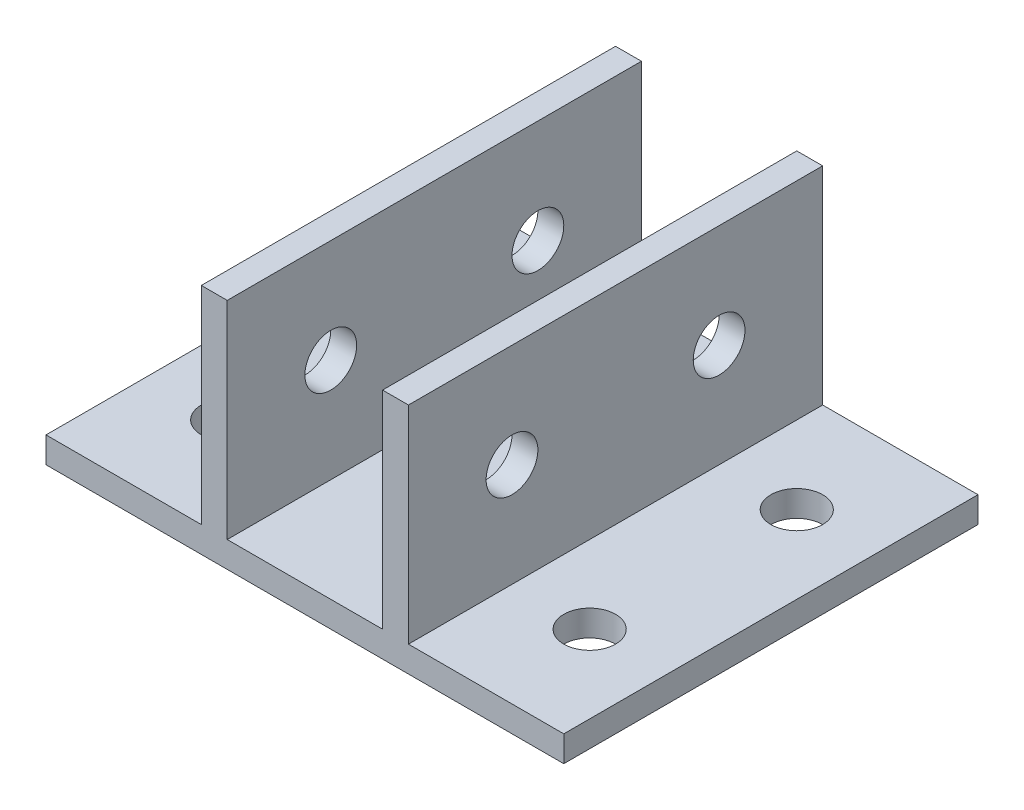
ISO-10303-21;
HEADER;
FILE_DESCRIPTION(('STEP AP214'),'2;1');
FILE_NAME('part.step','',(''),(''),'','','');
FILE_SCHEMA(('AUTOMOTIVE_DESIGN { 1 0 10303 214 1 1 1 1 }'));
ENDSEC;
DATA;
#1=APPLICATION_CONTEXT('core data for automotive mechanical design processes');
#2=APPLICATION_PROTOCOL_DEFINITION('international standard','automotive_design',2000,#1);
#3=PRODUCT_CONTEXT('',#1,'mechanical');
#4=PRODUCT('Part','Part','',(#3));
#5=PRODUCT_RELATED_PRODUCT_CATEGORY('part','',(#4));
#6=PRODUCT_DEFINITION_FORMATION('','',#4);
#7=PRODUCT_DEFINITION_CONTEXT('part definition',#1,'design');
#8=PRODUCT_DEFINITION('design','',#6,#7);
#9=PRODUCT_DEFINITION_SHAPE('','',#8);
#10=(LENGTH_UNIT() NAMED_UNIT(*) SI_UNIT(.MILLI.,.METRE.));
#11=(NAMED_UNIT(*) PLANE_ANGLE_UNIT() SI_UNIT($,.RADIAN.));
#12=(NAMED_UNIT(*) SI_UNIT($,.STERADIAN.) SOLID_ANGLE_UNIT());
#13=UNCERTAINTY_MEASURE_WITH_UNIT(LENGTH_MEASURE(1.E-05),#10,'distance_accuracy_value','');
#14=(GEOMETRIC_REPRESENTATION_CONTEXT(3) GLOBAL_UNCERTAINTY_ASSIGNED_CONTEXT((#13)) GLOBAL_UNIT_ASSIGNED_CONTEXT((#10,
#11,#12)) REPRESENTATION_CONTEXT('',''));
#15=CARTESIAN_POINT('',(0.,0.,0.));
#16=DIRECTION('',(0.,0.,1.));
#17=DIRECTION('',(1.,0.,0.));
#18=AXIS2_PLACEMENT_3D('',#15,#16,#17);
#19=CARTESIAN_POINT('',(0.,0.,50.8));
#20=DIRECTION('',(0.,1.,0.));
#21=DIRECTION('',(0.,0.,1.));
#22=AXIS2_PLACEMENT_3D('',#19,#20,#21);
#23=PLANE('',#22);
#24=CARTESIAN_POINT('',(53.975,0.,38.1));
#25=DIRECTION('',(0.,1.,0.));
#26=DIRECTION('',(-1.,0.,0.));
#27=AXIS2_PLACEMENT_3D('',#24,#25,#26);
#28=CIRCLE('',#27,3.175);
#29=CARTESIAN_POINT('',(50.8,0.,38.1));
#30=VERTEX_POINT('',#29);
#31=EDGE_CURVE('E267',#30,#30,#28,.F.);
#32=ORIENTED_EDGE('',*,*,#31,.F.);
#33=EDGE_LOOP('',(#32));
#34=FACE_BOUND('',#33,.T.);
#35=CARTESIAN_POINT('',(9.525,0.,12.7));
#36=DIRECTION('',(0.,1.,0.));
#37=DIRECTION('',(-1.,0.,0.));
#38=AXIS2_PLACEMENT_3D('',#35,#36,#37);
#39=CIRCLE('',#38,3.175);
#40=CARTESIAN_POINT('',(6.35,0.,12.7));
#41=VERTEX_POINT('',#40);
#42=EDGE_CURVE('E256',#41,#41,#39,.T.);
#43=ORIENTED_EDGE('',*,*,#42,.T.);
#44=EDGE_LOOP('',(#43));
#45=FACE_BOUND('',#44,.T.);
#46=CARTESIAN_POINT('',(9.525,0.,38.1));
#47=DIRECTION('',(0.,1.,0.));
#48=DIRECTION('',(-1.,0.,0.));
#49=AXIS2_PLACEMENT_3D('',#46,#47,#48);
#50=CIRCLE('',#49,3.175);
#51=CARTESIAN_POINT('',(6.35,0.,38.1));
#52=VERTEX_POINT('',#51);
#53=EDGE_CURVE('E273',#52,#52,#50,.F.);
#54=ORIENTED_EDGE('',*,*,#53,.F.);
#55=EDGE_LOOP('',(#54));
#56=FACE_BOUND('',#55,.T.);
#57=DIRECTION('',(1.,0.,0.));
#58=VECTOR('',#57,1.);
#59=CARTESIAN_POINT('',(0.,0.,0.));
#60=LINE('',#59,#58);
#61=CARTESIAN_POINT('',(0.,0.,0.));
#62=VERTEX_POINT('',#61);
#63=CARTESIAN_POINT('',(63.5,0.,0.));
#64=VERTEX_POINT('',#63);
#65=EDGE_CURVE('E156',#62,#64,#60,.T.);
#66=ORIENTED_EDGE('',*,*,#65,.T.);
#67=DIRECTION('',(0.,0.,-1.));
#68=VECTOR('',#67,1.);
#69=CARTESIAN_POINT('',(63.5,0.,50.8));
#70=LINE('',#69,#68);
#71=CARTESIAN_POINT('',(63.5,0.,50.8));
#72=VERTEX_POINT('',#71);
#73=EDGE_CURVE('E41',#72,#64,#70,.T.);
#74=ORIENTED_EDGE('',*,*,#73,.F.);
#75=DIRECTION('',(1.,0.,0.));
#76=VECTOR('',#75,1.);
#77=CARTESIAN_POINT('',(0.,0.,50.8));
#78=LINE('',#77,#76);
#79=CARTESIAN_POINT('',(0.,0.,50.8));
#80=VERTEX_POINT('',#79);
#81=EDGE_CURVE('E104',#80,#72,#78,.T.);
#82=ORIENTED_EDGE('',*,*,#81,.F.);
#83=DIRECTION('',(0.,0.,-1.));
#84=VECTOR('',#83,1.);
#85=CARTESIAN_POINT('',(0.,0.,50.8));
#86=LINE('',#85,#84);
#87=EDGE_CURVE('E11',#80,#62,#86,.T.);
#88=ORIENTED_EDGE('',*,*,#87,.T.);
#89=EDGE_LOOP('',(#66,#74,#82,#88));
#90=FACE_BOUND('',#89,.T.);
#91=CARTESIAN_POINT('',(53.975,0.,12.7));
#92=DIRECTION('',(0.,1.,0.));
#93=DIRECTION('',(-1.,0.,0.));
#94=AXIS2_PLACEMENT_3D('',#91,#92,#93);
#95=CIRCLE('',#94,3.175);
#96=CARTESIAN_POINT('',(50.8,0.,12.7));
#97=VERTEX_POINT('',#96);
#98=EDGE_CURVE('E257',#97,#97,#95,.T.);
#99=ORIENTED_EDGE('',*,*,#98,.T.);
#100=EDGE_LOOP('',(#99));
#101=FACE_BOUND('',#100,.T.);
#102=ADVANCED_FACE('F32',(#34,#45,#56,#90,#101),#23,.F.);
#103=CARTESIAN_POINT('',(63.5,3.17500000000001,50.8));
#104=DIRECTION('',(0.,-1.,0.));
#105=DIRECTION('',(1.,0.,0.));
#106=AXIS2_PLACEMENT_3D('',#103,#104,#105);
#107=PLANE('',#106);
#108=CARTESIAN_POINT('',(53.975,3.175,12.7));
#109=DIRECTION('',(0.,1.,0.));
#110=DIRECTION('',(-1.,0.,0.));
#111=AXIS2_PLACEMENT_3D('',#108,#109,#110);
#112=CIRCLE('',#111,3.175);
#113=CARTESIAN_POINT('',(50.8,3.175,12.7));
#114=VERTEX_POINT('',#113);
#115=EDGE_CURVE('E262',#114,#114,#112,.T.);
#116=ORIENTED_EDGE('',*,*,#115,.F.);
#117=EDGE_LOOP('',(#116));
#118=FACE_BOUND('',#117,.T.);
#119=DIRECTION('',(-1.,0.,0.));
#120=VECTOR('',#119,1.);
#121=CARTESIAN_POINT('',(63.5,3.17500000000001,0.));
#122=LINE('',#121,#120);
#123=CARTESIAN_POINT('',(63.5,3.17500000000001,0.));
#124=VERTEX_POINT('',#123);
#125=CARTESIAN_POINT('',(44.45,3.175,0.));
#126=VERTEX_POINT('',#125);
#127=EDGE_CURVE('E161',#124,#126,#122,.T.);
#128=ORIENTED_EDGE('',*,*,#127,.T.);
#129=DIRECTION('',(0.,0.,-1.));
#130=VECTOR('',#129,1.);
#131=CARTESIAN_POINT('',(44.45,3.175,50.8));
#132=LINE('',#131,#130);
#133=CARTESIAN_POINT('',(44.45,3.175,50.8));
#134=VERTEX_POINT('',#133);
#135=EDGE_CURVE('E192',#134,#126,#132,.T.);
#136=ORIENTED_EDGE('',*,*,#135,.F.);
#137=DIRECTION('',(-1.,0.,0.));
#138=VECTOR('',#137,1.);
#139=CARTESIAN_POINT('',(63.5,3.17500000000001,50.8));
#140=LINE('',#139,#138);
#141=CARTESIAN_POINT('',(63.5,3.17500000000001,50.8));
#142=VERTEX_POINT('',#141);
#143=EDGE_CURVE('E222',#142,#134,#140,.T.);
#144=ORIENTED_EDGE('',*,*,#143,.F.);
#145=DIRECTION('',(0.,0.,-1.));
#146=VECTOR('',#145,1.);
#147=CARTESIAN_POINT('',(63.5,3.17500000000001,50.8));
#148=LINE('',#147,#146);
#149=EDGE_CURVE('E195',#142,#124,#148,.T.);
#150=ORIENTED_EDGE('',*,*,#149,.T.);
#151=EDGE_LOOP('',(#128,#136,#144,#150));
#152=FACE_BOUND('',#151,.T.);
#153=CARTESIAN_POINT('',(53.975,3.175,38.1));
#154=DIRECTION('',(0.,1.,0.));
#155=DIRECTION('',(-1.,0.,0.));
#156=AXIS2_PLACEMENT_3D('',#153,#154,#155);
#157=CIRCLE('',#156,3.175);
#158=CARTESIAN_POINT('',(50.8,3.175,38.1));
#159=VERTEX_POINT('',#158);
#160=EDGE_CURVE('E270',#159,#159,#157,.F.);
#161=ORIENTED_EDGE('',*,*,#160,.T.);
#162=EDGE_LOOP('',(#161));
#163=FACE_BOUND('',#162,.T.);
#164=ADVANCED_FACE('F212',(#118,#152,#163),#107,.F.);
#165=CARTESIAN_POINT('',(19.05,3.175,50.8));
#166=DIRECTION('',(0.,-1.,0.));
#167=DIRECTION('',(1.,0.,0.));
#168=AXIS2_PLACEMENT_3D('',#165,#166,#167);
#169=PLANE('',#168);
#170=DIRECTION('',(-1.,0.,0.));
#171=VECTOR('',#170,1.);
#172=CARTESIAN_POINT('',(19.05,3.175,0.));
#173=LINE('',#172,#171);
#174=CARTESIAN_POINT('',(19.05,3.175,0.));
#175=VERTEX_POINT('',#174);
#176=CARTESIAN_POINT('',(0.,3.175,0.));
#177=VERTEX_POINT('',#176);
#178=EDGE_CURVE('E96',#175,#177,#173,.T.);
#179=ORIENTED_EDGE('',*,*,#178,.T.);
#180=DIRECTION('',(0.,0.,-1.));
#181=VECTOR('',#180,1.);
#182=CARTESIAN_POINT('',(0.,3.175,50.8));
#183=LINE('',#182,#181);
#184=CARTESIAN_POINT('',(0.,3.175,50.8));
#185=VERTEX_POINT('',#184);
#186=EDGE_CURVE('E149',#185,#177,#183,.T.);
#187=ORIENTED_EDGE('',*,*,#186,.F.);
#188=DIRECTION('',(-1.,0.,0.));
#189=VECTOR('',#188,1.);
#190=CARTESIAN_POINT('',(19.05,3.175,50.8));
#191=LINE('',#190,#189);
#192=CARTESIAN_POINT('',(19.05,3.175,50.8));
#193=VERTEX_POINT('',#192);
#194=EDGE_CURVE('E49',#193,#185,#191,.T.);
#195=ORIENTED_EDGE('',*,*,#194,.F.);
#196=DIRECTION('',(0.,0.,-1.));
#197=VECTOR('',#196,1.);
#198=CARTESIAN_POINT('',(19.05,3.175,50.8));
#199=LINE('',#198,#197);
#200=EDGE_CURVE('E145',#193,#175,#199,.T.);
#201=ORIENTED_EDGE('',*,*,#200,.T.);
#202=EDGE_LOOP('',(#179,#187,#195,#201));
#203=FACE_BOUND('',#202,.T.);
#204=CARTESIAN_POINT('',(9.525,3.175,38.1));
#205=DIRECTION('',(0.,1.,0.));
#206=DIRECTION('',(-1.,0.,0.));
#207=AXIS2_PLACEMENT_3D('',#204,#205,#206);
#208=CIRCLE('',#207,3.175);
#209=CARTESIAN_POINT('',(6.35,3.175,38.1));
#210=VERTEX_POINT('',#209);
#211=EDGE_CURVE('E251',#210,#210,#208,.F.);
#212=ORIENTED_EDGE('',*,*,#211,.T.);
#213=EDGE_LOOP('',(#212));
#214=FACE_BOUND('',#213,.T.);
#215=CARTESIAN_POINT('',(9.525,3.175,12.7));
#216=DIRECTION('',(0.,1.,0.));
#217=DIRECTION('',(-1.,0.,0.));
#218=AXIS2_PLACEMENT_3D('',#215,#216,#217);
#219=CIRCLE('',#218,3.175);
#220=CARTESIAN_POINT('',(6.35,3.175,12.7));
#221=VERTEX_POINT('',#220);
#222=EDGE_CURVE('E254',#221,#221,#219,.T.);
#223=ORIENTED_EDGE('',*,*,#222,.F.);
#224=EDGE_LOOP('',(#223));
#225=FACE_BOUND('',#224,.T.);
#226=ADVANCED_FACE('F244',(#203,#214,#225),#169,.F.);
#227=CARTESIAN_POINT('',(0.,3.175,50.8));
#228=DIRECTION('',(1.,0.,0.));
#229=DIRECTION('',(0.,1.,0.));
#230=AXIS2_PLACEMENT_3D('',#227,#228,#229);
#231=PLANE('',#230);
#232=DIRECTION('',(0.,-1.,0.));
#233=VECTOR('',#232,1.);
#234=CARTESIAN_POINT('',(0.,3.175,0.));
#235=LINE('',#234,#233);
#236=EDGE_CURVE('E153',#177,#62,#235,.T.);
#237=ORIENTED_EDGE('',*,*,#236,.T.);
#238=ORIENTED_EDGE('',*,*,#87,.F.);
#239=DIRECTION('',(0.,-1.,0.));
#240=VECTOR('',#239,1.);
#241=CARTESIAN_POINT('',(0.,3.175,50.8));
#242=LINE('',#241,#240);
#243=EDGE_CURVE('E176',#185,#80,#242,.T.);
#244=ORIENTED_EDGE('',*,*,#243,.F.);
#245=ORIENTED_EDGE('',*,*,#186,.T.);
#246=EDGE_LOOP('',(#237,#238,#244,#245));
#247=FACE_BOUND('',#246,.T.);
#248=ADVANCED_FACE('F34',(#247),#231,.F.);
#249=CARTESIAN_POINT('',(63.5,0.,50.8));
#250=DIRECTION('',(-1.,0.,0.));
#251=DIRECTION('',(0.,0.,1.));
#252=AXIS2_PLACEMENT_3D('',#249,#250,#251);
#253=PLANE('',#252);
#254=DIRECTION('',(0.,1.,0.));
#255=VECTOR('',#254,1.);
#256=CARTESIAN_POINT('',(63.5,0.,0.));
#257=LINE('',#256,#255);
#258=EDGE_CURVE('E159',#64,#124,#257,.T.);
#259=ORIENTED_EDGE('',*,*,#258,.T.);
#260=ORIENTED_EDGE('',*,*,#149,.F.);
#261=DIRECTION('',(0.,1.,0.));
#262=VECTOR('',#261,1.);
#263=CARTESIAN_POINT('',(63.5,0.,50.8));
#264=LINE('',#263,#262);
#265=EDGE_CURVE('E203',#72,#142,#264,.T.);
#266=ORIENTED_EDGE('',*,*,#265,.F.);
#267=ORIENTED_EDGE('',*,*,#73,.T.);
#268=EDGE_LOOP('',(#259,#260,#266,#267));
#269=FACE_BOUND('',#268,.T.);
#270=ADVANCED_FACE('F201',(#269),#253,.F.);
#271=CARTESIAN_POINT('',(44.45,3.175,50.8));
#272=DIRECTION('',(-1.,0.,0.));
#273=DIRECTION('',(0.,0.,1.));
#274=AXIS2_PLACEMENT_3D('',#271,#272,#273);
#275=PLANE('',#274);
#276=CARTESIAN_POINT('',(44.45,15.875,12.7));
#277=DIRECTION('',(-1.,0.,0.));
#278=DIRECTION('',(0.,0.,1.));
#279=AXIS2_PLACEMENT_3D('',#276,#277,#278);
#280=CIRCLE('',#279,3.175);
#281=CARTESIAN_POINT('',(44.45,15.875,15.875));
#282=VERTEX_POINT('',#281);
#283=EDGE_CURVE('E157',#282,#282,#280,.T.);
#284=ORIENTED_EDGE('',*,*,#283,.T.);
#285=EDGE_LOOP('',(#284));
#286=FACE_BOUND('',#285,.T.);
#287=CARTESIAN_POINT('',(44.45,15.875,38.1));
#288=DIRECTION('',(-1.,0.,0.));
#289=DIRECTION('',(0.,0.,1.));
#290=AXIS2_PLACEMENT_3D('',#287,#288,#289);
#291=CIRCLE('',#290,3.175);
#292=CARTESIAN_POINT('',(44.45,15.875,41.275));
#293=VERTEX_POINT('',#292);
#294=EDGE_CURVE('E289',#293,#293,#291,.T.);
#295=ORIENTED_EDGE('',*,*,#294,.T.);
#296=EDGE_LOOP('',(#295));
#297=FACE_BOUND('',#296,.T.);
#298=DIRECTION('',(0.,1.,0.));
#299=VECTOR('',#298,1.);
#300=CARTESIAN_POINT('',(44.45,3.175,0.));
#301=LINE('',#300,#299);
#302=CARTESIAN_POINT('',(44.45,28.575,0.));
#303=VERTEX_POINT('',#302);
#304=EDGE_CURVE('E163',#126,#303,#301,.T.);
#305=ORIENTED_EDGE('',*,*,#304,.T.);
#306=DIRECTION('',(0.,0.,-1.));
#307=VECTOR('',#306,1.);
#308=CARTESIAN_POINT('',(44.45,28.575,50.8));
#309=LINE('',#308,#307);
#310=CARTESIAN_POINT('',(44.45,28.575,50.8));
#311=VERTEX_POINT('',#310);
#312=EDGE_CURVE('E189',#311,#303,#309,.T.);
#313=ORIENTED_EDGE('',*,*,#312,.F.);
#314=DIRECTION('',(0.,1.,0.));
#315=VECTOR('',#314,1.);
#316=CARTESIAN_POINT('',(44.45,3.175,50.8));
#317=LINE('',#316,#315);
#318=EDGE_CURVE('E219',#134,#311,#317,.T.);
#319=ORIENTED_EDGE('',*,*,#318,.F.);
#320=ORIENTED_EDGE('',*,*,#135,.T.);
#321=EDGE_LOOP('',(#305,#313,#319,#320));
#322=FACE_BOUND('',#321,.T.);
#323=ADVANCED_FACE('F217',(#286,#297,#322),#275,.F.);
#324=CARTESIAN_POINT('',(44.45,28.575,50.8));
#325=DIRECTION('',(0.,-1.,0.));
#326=DIRECTION('',(1.,0.,0.));
#327=AXIS2_PLACEMENT_3D('',#324,#325,#326);
#328=PLANE('',#327);
#329=DIRECTION('',(-1.,0.,0.));
#330=VECTOR('',#329,1.);
#331=CARTESIAN_POINT('',(44.45,28.575,0.));
#332=LINE('',#331,#330);
#333=CARTESIAN_POINT('',(41.275,28.575,0.));
#334=VERTEX_POINT('',#333);
#335=EDGE_CURVE('E165',#303,#334,#332,.T.);
#336=ORIENTED_EDGE('',*,*,#335,.T.);
#337=DIRECTION('',(0.,0.,-1.));
#338=VECTOR('',#337,1.);
#339=CARTESIAN_POINT('',(41.275,28.575,50.8));
#340=LINE('',#339,#338);
#341=CARTESIAN_POINT('',(41.275,28.575,50.8));
#342=VERTEX_POINT('',#341);
#343=EDGE_CURVE('E186',#342,#334,#340,.T.);
#344=ORIENTED_EDGE('',*,*,#343,.F.);
#345=DIRECTION('',(-1.,0.,0.));
#346=VECTOR('',#345,1.);
#347=CARTESIAN_POINT('',(44.45,28.575,50.8));
#348=LINE('',#347,#346);
#349=EDGE_CURVE('E221',#311,#342,#348,.T.);
#350=ORIENTED_EDGE('',*,*,#349,.F.);
#351=ORIENTED_EDGE('',*,*,#312,.T.);
#352=EDGE_LOOP('',(#336,#344,#350,#351));
#353=FACE_BOUND('',#352,.T.);
#354=ADVANCED_FACE('F339',(#353),#328,.F.);
#355=CARTESIAN_POINT('',(41.275,28.575,50.8));
#356=DIRECTION('',(1.,0.,0.));
#357=DIRECTION('',(0.,1.,0.));
#358=AXIS2_PLACEMENT_3D('',#355,#356,#357);
#359=PLANE('',#358);
#360=CARTESIAN_POINT('',(41.275,15.875,12.7));
#361=DIRECTION('',(1.,0.,0.));
#362=DIRECTION('',(0.,1.,0.));
#363=AXIS2_PLACEMENT_3D('',#360,#361,#362);
#364=CIRCLE('',#363,3.175);
#365=CARTESIAN_POINT('',(41.275,19.05,12.7));
#366=VERTEX_POINT('',#365);
#367=EDGE_CURVE('E295',#366,#366,#364,.T.);
#368=ORIENTED_EDGE('',*,*,#367,.T.);
#369=EDGE_LOOP('',(#368));
#370=FACE_BOUND('',#369,.T.);
#371=CARTESIAN_POINT('',(41.275,15.875,38.1));
#372=DIRECTION('',(1.,0.,0.));
#373=DIRECTION('',(0.,1.,0.));
#374=AXIS2_PLACEMENT_3D('',#371,#372,#373);
#375=CIRCLE('',#374,3.175);
#376=CARTESIAN_POINT('',(41.275,19.05,38.1));
#377=VERTEX_POINT('',#376);
#378=EDGE_CURVE('E286',#377,#377,#375,.T.);
#379=ORIENTED_EDGE('',*,*,#378,.T.);
#380=EDGE_LOOP('',(#379));
#381=FACE_BOUND('',#380,.T.);
#382=DIRECTION('',(0.,-1.,0.));
#383=VECTOR('',#382,1.);
#384=CARTESIAN_POINT('',(41.275,28.575,0.));
#385=LINE('',#384,#383);
#386=CARTESIAN_POINT('',(41.275,3.175,0.));
#387=VERTEX_POINT('',#386);
#388=EDGE_CURVE('E167',#334,#387,#385,.T.);
#389=ORIENTED_EDGE('',*,*,#388,.T.);
#390=DIRECTION('',(0.,0.,-1.));
#391=VECTOR('',#390,1.);
#392=CARTESIAN_POINT('',(41.275,3.175,50.8));
#393=LINE('',#392,#391);
#394=CARTESIAN_POINT('',(41.275,3.175,50.8));
#395=VERTEX_POINT('',#394);
#396=EDGE_CURVE('E183',#395,#387,#393,.T.);
#397=ORIENTED_EDGE('',*,*,#396,.F.);
#398=DIRECTION('',(0.,-1.,0.));
#399=VECTOR('',#398,1.);
#400=CARTESIAN_POINT('',(41.275,28.575,50.8));
#401=LINE('',#400,#399);
#402=EDGE_CURVE('E224',#342,#395,#401,.T.);
#403=ORIENTED_EDGE('',*,*,#402,.F.);
#404=ORIENTED_EDGE('',*,*,#343,.T.);
#405=EDGE_LOOP('',(#389,#397,#403,#404));
#406=FACE_BOUND('',#405,.T.);
#407=ADVANCED_FACE('F342',(#370,#381,#406),#359,.F.);
#408=CARTESIAN_POINT('',(41.275,3.175,50.8));
#409=DIRECTION('',(0.,-1.,0.));
#410=DIRECTION('',(1.,0.,0.));
#411=AXIS2_PLACEMENT_3D('',#408,#409,#410);
#412=PLANE('',#411);
#413=DIRECTION('',(-1.,0.,0.));
#414=VECTOR('',#413,1.);
#415=CARTESIAN_POINT('',(41.275,3.175,0.));
#416=LINE('',#415,#414);
#417=CARTESIAN_POINT('',(22.225,3.175,0.));
#418=VERTEX_POINT('',#417);
#419=EDGE_CURVE('E169',#387,#418,#416,.T.);
#420=ORIENTED_EDGE('',*,*,#419,.T.);
#421=DIRECTION('',(0.,0.,-1.));
#422=VECTOR('',#421,1.);
#423=CARTESIAN_POINT('',(22.225,3.175,50.8));
#424=LINE('',#423,#422);
#425=CARTESIAN_POINT('',(22.225,3.175,50.8));
#426=VERTEX_POINT('',#425);
#427=EDGE_CURVE('E180',#426,#418,#424,.T.);
#428=ORIENTED_EDGE('',*,*,#427,.F.);
#429=DIRECTION('',(-1.,0.,0.));
#430=VECTOR('',#429,1.);
#431=CARTESIAN_POINT('',(41.275,3.175,50.8));
#432=LINE('',#431,#430);
#433=EDGE_CURVE('E230',#395,#426,#432,.T.);
#434=ORIENTED_EDGE('',*,*,#433,.F.);
#435=ORIENTED_EDGE('',*,*,#396,.T.);
#436=EDGE_LOOP('',(#420,#428,#434,#435));
#437=FACE_BOUND('',#436,.T.);
#438=ADVANCED_FACE('F236',(#437),#412,.F.);
#439=CARTESIAN_POINT('',(22.225,3.175,50.8));
#440=DIRECTION('',(-1.,0.,0.));
#441=DIRECTION('',(0.,-1.,0.));
#442=AXIS2_PLACEMENT_3D('',#439,#440,#441);
#443=PLANE('',#442);
#444=CARTESIAN_POINT('',(22.225,15.875,12.7));
#445=DIRECTION('',(-1.,0.,0.));
#446=DIRECTION('',(0.,-1.,0.));
#447=AXIS2_PLACEMENT_3D('',#444,#445,#446);
#448=CIRCLE('',#447,3.175);
#449=CARTESIAN_POINT('',(22.225,12.7,12.7));
#450=VERTEX_POINT('',#449);
#451=EDGE_CURVE('E292',#450,#450,#448,.T.);
#452=ORIENTED_EDGE('',*,*,#451,.T.);
#453=EDGE_LOOP('',(#452));
#454=FACE_BOUND('',#453,.T.);
#455=CARTESIAN_POINT('',(22.225,15.875,38.1));
#456=DIRECTION('',(-1.,0.,0.));
#457=DIRECTION('',(0.,-1.,0.));
#458=AXIS2_PLACEMENT_3D('',#455,#456,#457);
#459=CIRCLE('',#458,3.175);
#460=CARTESIAN_POINT('',(22.225,12.7,38.1));
#461=VERTEX_POINT('',#460);
#462=EDGE_CURVE('E281',#461,#461,#459,.T.);
#463=ORIENTED_EDGE('',*,*,#462,.T.);
#464=EDGE_LOOP('',(#463));
#465=FACE_BOUND('',#464,.T.);
#466=DIRECTION('',(0.,1.,0.));
#467=VECTOR('',#466,1.);
#468=CARTESIAN_POINT('',(22.225,3.175,0.));
#469=LINE('',#468,#467);
#470=CARTESIAN_POINT('',(22.225,28.575,0.));
#471=VERTEX_POINT('',#470);
#472=EDGE_CURVE('E171',#418,#471,#469,.T.);
#473=ORIENTED_EDGE('',*,*,#472,.T.);
#474=DIRECTION('',(0.,0.,-1.));
#475=VECTOR('',#474,1.);
#476=CARTESIAN_POINT('',(22.225,28.575,50.8));
#477=LINE('',#476,#475);
#478=CARTESIAN_POINT('',(22.225,28.575,50.8));
#479=VERTEX_POINT('',#478);
#480=EDGE_CURVE('E144',#479,#471,#477,.T.);
#481=ORIENTED_EDGE('',*,*,#480,.F.);
#482=DIRECTION('',(0.,1.,0.));
#483=VECTOR('',#482,1.);
#484=CARTESIAN_POINT('',(22.225,3.175,50.8));
#485=LINE('',#484,#483);
#486=EDGE_CURVE('E135',#426,#479,#485,.T.);
#487=ORIENTED_EDGE('',*,*,#486,.F.);
#488=ORIENTED_EDGE('',*,*,#427,.T.);
#489=EDGE_LOOP('',(#473,#481,#487,#488));
#490=FACE_BOUND('',#489,.T.);
#491=ADVANCED_FACE('F240',(#454,#465,#490),#443,.F.);
#492=CARTESIAN_POINT('',(22.225,28.575,50.8));
#493=DIRECTION('',(0.,-1.,0.));
#494=DIRECTION('',(0.,0.,-1.));
#495=AXIS2_PLACEMENT_3D('',#492,#493,#494);
#496=PLANE('',#495);
#497=DIRECTION('',(-1.,0.,0.));
#498=VECTOR('',#497,1.);
#499=CARTESIAN_POINT('',(22.225,28.575,0.));
#500=LINE('',#499,#498);
#501=CARTESIAN_POINT('',(19.05,28.575,0.));
#502=VERTEX_POINT('',#501);
#503=EDGE_CURVE('E143',#471,#502,#500,.T.);
#504=ORIENTED_EDGE('',*,*,#503,.T.);
#505=DIRECTION('',(0.,0.,-1.));
#506=VECTOR('',#505,1.);
#507=CARTESIAN_POINT('',(19.05,28.575,50.8));
#508=LINE('',#507,#506);
#509=CARTESIAN_POINT('',(19.05,28.575,50.8));
#510=VERTEX_POINT('',#509);
#511=EDGE_CURVE('E140',#510,#502,#508,.T.);
#512=ORIENTED_EDGE('',*,*,#511,.F.);
#513=DIRECTION('',(-1.,0.,0.));
#514=VECTOR('',#513,1.);
#515=CARTESIAN_POINT('',(22.225,28.575,50.8));
#516=LINE('',#515,#514);
#517=EDGE_CURVE('E129',#479,#510,#516,.T.);
#518=ORIENTED_EDGE('',*,*,#517,.F.);
#519=ORIENTED_EDGE('',*,*,#480,.T.);
#520=EDGE_LOOP('',(#504,#512,#518,#519));
#521=FACE_BOUND('',#520,.T.);
#522=ADVANCED_FACE('F141',(#521),#496,.F.);
#523=CARTESIAN_POINT('',(19.05,28.575,50.8));
#524=DIRECTION('',(1.,0.,0.));
#525=DIRECTION('',(0.,1.,0.));
#526=AXIS2_PLACEMENT_3D('',#523,#524,#525);
#527=PLANE('',#526);
#528=CARTESIAN_POINT('',(19.05,15.875,12.7));
#529=DIRECTION('',(-1.,0.,0.));
#530=DIRECTION('',(0.,-1.,0.));
#531=AXIS2_PLACEMENT_3D('',#528,#529,#530);
#532=CIRCLE('',#531,3.175);
#533=CARTESIAN_POINT('',(19.05,12.7,12.7));
#534=VERTEX_POINT('',#533);
#535=EDGE_CURVE('E278',#534,#534,#532,.T.);
#536=ORIENTED_EDGE('',*,*,#535,.F.);
#537=EDGE_LOOP('',(#536));
#538=FACE_BOUND('',#537,.T.);
#539=CARTESIAN_POINT('',(19.05,15.875,38.1));
#540=DIRECTION('',(-1.,0.,0.));
#541=DIRECTION('',(0.,-1.,0.));
#542=AXIS2_PLACEMENT_3D('',#539,#540,#541);
#543=CIRCLE('',#542,3.175);
#544=CARTESIAN_POINT('',(19.05,12.7,38.1));
#545=VERTEX_POINT('',#544);
#546=EDGE_CURVE('E276',#545,#545,#543,.T.);
#547=ORIENTED_EDGE('',*,*,#546,.F.);
#548=EDGE_LOOP('',(#547));
#549=FACE_BOUND('',#548,.T.);
#550=DIRECTION('',(0.,-1.,0.));
#551=VECTOR('',#550,1.);
#552=CARTESIAN_POINT('',(19.05,28.575,0.));
#553=LINE('',#552,#551);
#554=EDGE_CURVE('E90',#502,#175,#553,.T.);
#555=ORIENTED_EDGE('',*,*,#554,.T.);
#556=ORIENTED_EDGE('',*,*,#200,.F.);
#557=DIRECTION('',(0.,-1.,0.));
#558=VECTOR('',#557,1.);
#559=CARTESIAN_POINT('',(19.05,28.575,50.8));
#560=LINE('',#559,#558);
#561=EDGE_CURVE('E133',#510,#193,#560,.T.);
#562=ORIENTED_EDGE('',*,*,#561,.F.);
#563=ORIENTED_EDGE('',*,*,#511,.T.);
#564=EDGE_LOOP('',(#555,#556,#562,#563));
#565=FACE_BOUND('',#564,.T.);
#566=ADVANCED_FACE('F147',(#538,#549,#565),#527,.F.);
#567=CARTESIAN_POINT('',(0.,0.,50.8));
#568=DIRECTION('',(0.,0.,1.));
#569=DIRECTION('',(1.,0.,0.));
#570=AXIS2_PLACEMENT_3D('',#567,#568,#569);
#571=PLANE('',#570);
#572=ORIENTED_EDGE('',*,*,#243,.T.);
#573=ORIENTED_EDGE('',*,*,#81,.T.);
#574=ORIENTED_EDGE('',*,*,#265,.T.);
#575=ORIENTED_EDGE('',*,*,#143,.T.);
#576=ORIENTED_EDGE('',*,*,#318,.T.);
#577=ORIENTED_EDGE('',*,*,#349,.T.);
#578=ORIENTED_EDGE('',*,*,#402,.T.);
#579=ORIENTED_EDGE('',*,*,#433,.T.);
#580=ORIENTED_EDGE('',*,*,#486,.T.);
#581=ORIENTED_EDGE('',*,*,#517,.T.);
#582=ORIENTED_EDGE('',*,*,#561,.T.);
#583=ORIENTED_EDGE('',*,*,#194,.T.);
#584=EDGE_LOOP('',(#572,#573,#574,#575,#576,#577,#578,#579,#580,#581,#582,#583));
#585=FACE_BOUND('',#584,.T.);
#586=ADVANCED_FACE('F131',(#585),#571,.T.);
#587=CARTESIAN_POINT('',(0.,0.,0.));
#588=DIRECTION('',(0.,0.,1.));
#589=DIRECTION('',(1.,0.,0.));
#590=AXIS2_PLACEMENT_3D('',#587,#588,#589);
#591=PLANE('',#590);
#592=ORIENTED_EDGE('',*,*,#236,.F.);
#593=ORIENTED_EDGE('',*,*,#178,.F.);
#594=ORIENTED_EDGE('',*,*,#554,.F.);
#595=ORIENTED_EDGE('',*,*,#503,.F.);
#596=ORIENTED_EDGE('',*,*,#472,.F.);
#597=ORIENTED_EDGE('',*,*,#419,.F.);
#598=ORIENTED_EDGE('',*,*,#388,.F.);
#599=ORIENTED_EDGE('',*,*,#335,.F.);
#600=ORIENTED_EDGE('',*,*,#304,.F.);
#601=ORIENTED_EDGE('',*,*,#127,.F.);
#602=ORIENTED_EDGE('',*,*,#258,.F.);
#603=ORIENTED_EDGE('',*,*,#65,.F.);
#604=EDGE_LOOP('',(#592,#593,#594,#595,#596,#597,#598,#599,#600,#601,#602,#603));
#605=FACE_BOUND('',#604,.T.);
#606=ADVANCED_FACE('F207',(#605),#591,.F.);
#607=CARTESIAN_POINT('',(63.5,15.875,38.1));
#608=DIRECTION('',(-1.,0.,0.));
#609=DIRECTION('',(0.,-1.,0.));
#610=AXIS2_PLACEMENT_3D('',#607,#608,#609);
#611=CYLINDRICAL_SURFACE('',#610,3.175);
#612=ORIENTED_EDGE('',*,*,#546,.T.);
#613=EDGE_LOOP('',(#612));
#614=FACE_BOUND('',#613,.T.);
#615=ORIENTED_EDGE('',*,*,#462,.F.);
#616=EDGE_LOOP('',(#615));
#617=FACE_BOUND('',#616,.T.);
#618=ADVANCED_FACE('F321',(#614,#617),#611,.F.);
#619=CARTESIAN_POINT('',(63.5,15.875,12.7));
#620=DIRECTION('',(-1.,0.,0.));
#621=DIRECTION('',(0.,-1.,0.));
#622=AXIS2_PLACEMENT_3D('',#619,#620,#621);
#623=CYLINDRICAL_SURFACE('',#622,3.175);
#624=ORIENTED_EDGE('',*,*,#535,.T.);
#625=EDGE_LOOP('',(#624));
#626=FACE_BOUND('',#625,.T.);
#627=ORIENTED_EDGE('',*,*,#451,.F.);
#628=EDGE_LOOP('',(#627));
#629=FACE_BOUND('',#628,.T.);
#630=ADVANCED_FACE('F311',(#626,#629),#623,.F.);
#631=ORIENTED_EDGE('',*,*,#378,.F.);
#632=EDGE_LOOP('',(#631));
#633=FACE_BOUND('',#632,.T.);
#634=ORIENTED_EDGE('',*,*,#294,.F.);
#635=EDGE_LOOP('',(#634));
#636=FACE_BOUND('',#635,.T.);
#637=ADVANCED_FACE('F308',(#633,#636),#611,.F.);
#638=ORIENTED_EDGE('',*,*,#367,.F.);
#639=EDGE_LOOP('',(#638));
#640=FACE_BOUND('',#639,.T.);
#641=ORIENTED_EDGE('',*,*,#283,.F.);
#642=EDGE_LOOP('',(#641));
#643=FACE_BOUND('',#642,.T.);
#644=ADVANCED_FACE('F305',(#640,#643),#623,.F.);
#645=CARTESIAN_POINT('',(9.525,0.,38.1));
#646=DIRECTION('',(0.,1.,0.));
#647=DIRECTION('',(-1.,0.,0.));
#648=AXIS2_PLACEMENT_3D('',#645,#646,#647);
#649=CYLINDRICAL_SURFACE('',#648,3.175);
#650=ORIENTED_EDGE('',*,*,#53,.T.);
#651=EDGE_LOOP('',(#650));
#652=FACE_BOUND('',#651,.T.);
#653=ORIENTED_EDGE('',*,*,#211,.F.);
#654=EDGE_LOOP('',(#653));
#655=FACE_BOUND('',#654,.T.);
#656=ADVANCED_FACE('F307',(#652,#655),#649,.F.);
#657=CARTESIAN_POINT('',(9.525,0.,12.7));
#658=DIRECTION('',(0.,1.,0.));
#659=DIRECTION('',(-1.,0.,0.));
#660=AXIS2_PLACEMENT_3D('',#657,#658,#659);
#661=CYLINDRICAL_SURFACE('',#660,3.175);
#662=ORIENTED_EDGE('',*,*,#42,.F.);
#663=EDGE_LOOP('',(#662));
#664=FACE_BOUND('',#663,.T.);
#665=ORIENTED_EDGE('',*,*,#222,.T.);
#666=EDGE_LOOP('',(#665));
#667=FACE_BOUND('',#666,.T.);
#668=ADVANCED_FACE('F316',(#664,#667),#661,.F.);
#669=CARTESIAN_POINT('',(53.975,0.,12.7));
#670=DIRECTION('',(0.,1.,0.));
#671=DIRECTION('',(-1.,0.,0.));
#672=AXIS2_PLACEMENT_3D('',#669,#670,#671);
#673=CYLINDRICAL_SURFACE('',#672,3.175);
#674=ORIENTED_EDGE('',*,*,#98,.F.);
#675=EDGE_LOOP('',(#674));
#676=FACE_BOUND('',#675,.T.);
#677=ORIENTED_EDGE('',*,*,#115,.T.);
#678=EDGE_LOOP('',(#677));
#679=FACE_BOUND('',#678,.T.);
#680=ADVANCED_FACE('F420',(#676,#679),#673,.F.);
#681=CARTESIAN_POINT('',(53.975,0.,38.1));
#682=DIRECTION('',(0.,1.,0.));
#683=DIRECTION('',(-1.,0.,0.));
#684=AXIS2_PLACEMENT_3D('',#681,#682,#683);
#685=CYLINDRICAL_SURFACE('',#684,3.175);
#686=ORIENTED_EDGE('',*,*,#31,.T.);
#687=EDGE_LOOP('',(#686));
#688=FACE_BOUND('',#687,.T.);
#689=ORIENTED_EDGE('',*,*,#160,.F.);
#690=EDGE_LOOP('',(#689));
#691=FACE_BOUND('',#690,.T.);
#692=ADVANCED_FACE('F430',(#688,#691),#685,.F.);
#693=CLOSED_SHELL('',(#102,#164,#226,#248,#270,#323,#354,#407,#438,#491,#522,#566,#586,#606,
#618,#630,#637,#644,#656,#668,#680,#692));
#694=MANIFOLD_SOLID_BREP('B2',#693);
#695=ADVANCED_BREP_SHAPE_REPRESENTATION('',(#18,#694),#14);
#696=SHAPE_DEFINITION_REPRESENTATION(#9,#695);
ENDSEC;
END-ISO-10303-21;
